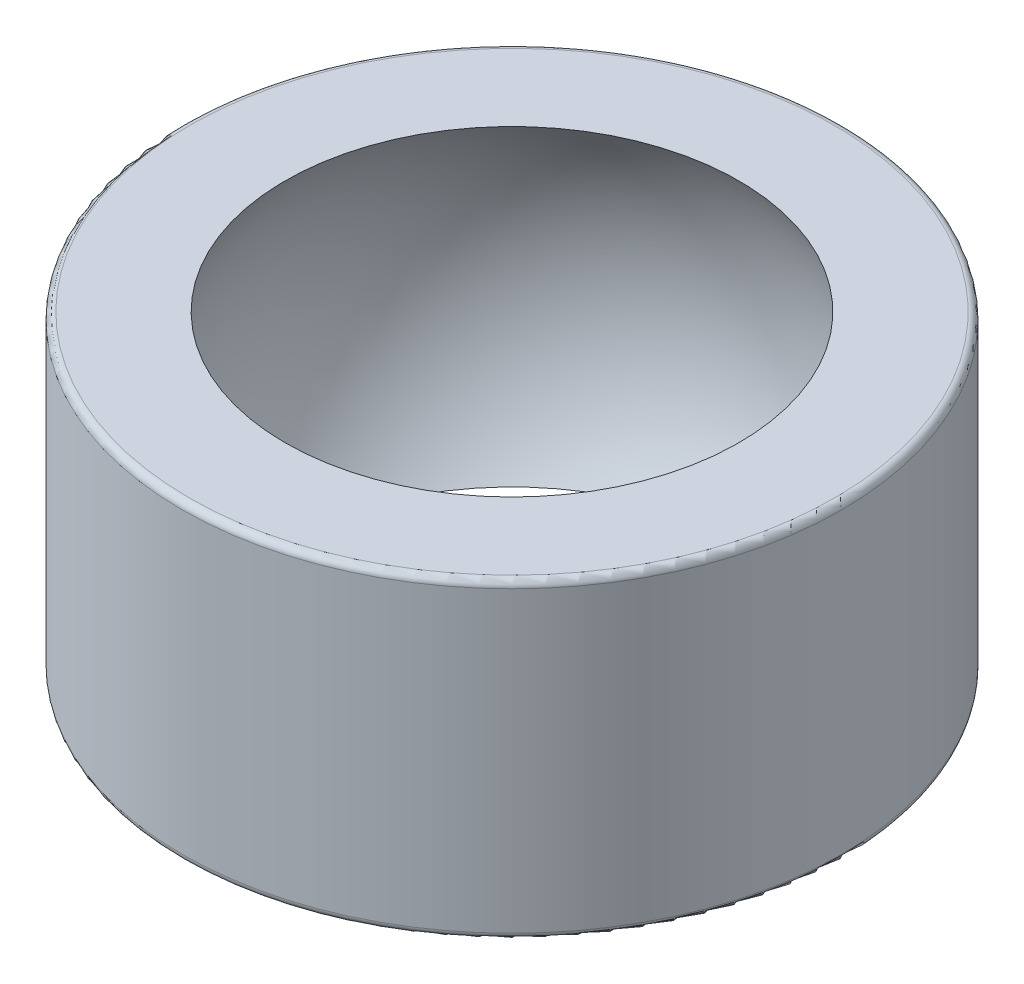
ISO-10303-21;
HEADER;
FILE_DESCRIPTION(('STEP AP214'),'2;1');
FILE_NAME('part.step','',(''),(''),'','','');
FILE_SCHEMA(('AUTOMOTIVE_DESIGN { 1 0 10303 214 1 1 1 1 }'));
ENDSEC;
DATA;
#1=APPLICATION_CONTEXT('core data for automotive mechanical design processes');
#2=APPLICATION_PROTOCOL_DEFINITION('international standard','automotive_design',2000,#1);
#3=PRODUCT_CONTEXT('',#1,'mechanical');
#4=PRODUCT('Part','Part','',(#3));
#5=PRODUCT_RELATED_PRODUCT_CATEGORY('part','',(#4));
#6=PRODUCT_DEFINITION_FORMATION('','',#4);
#7=PRODUCT_DEFINITION_CONTEXT('part definition',#1,'design');
#8=PRODUCT_DEFINITION('design','',#6,#7);
#9=PRODUCT_DEFINITION_SHAPE('','',#8);
#10=(LENGTH_UNIT() NAMED_UNIT(*) SI_UNIT(.MILLI.,.METRE.));
#11=(NAMED_UNIT(*) PLANE_ANGLE_UNIT() SI_UNIT($,.RADIAN.));
#12=(NAMED_UNIT(*) SI_UNIT($,.STERADIAN.) SOLID_ANGLE_UNIT());
#13=UNCERTAINTY_MEASURE_WITH_UNIT(LENGTH_MEASURE(1.E-05),#10,'distance_accuracy_value','');
#14=(GEOMETRIC_REPRESENTATION_CONTEXT(3) GLOBAL_UNCERTAINTY_ASSIGNED_CONTEXT((#13)) GLOBAL_UNIT_ASSIGNED_CONTEXT((#10,
#11,#12)) REPRESENTATION_CONTEXT('',''));
#15=CARTESIAN_POINT('',(0.,0.,0.));
#16=DIRECTION('',(0.,0.,1.));
#17=DIRECTION('',(1.,0.,0.));
#18=AXIS2_PLACEMENT_3D('',#15,#16,#17);
#19=CARTESIAN_POINT('',(0.,4.5,0.));
#20=DIRECTION('',(0.,-1.,0.));
#21=DIRECTION('',(0.,0.,-1.));
#22=AXIS2_PLACEMENT_3D('',#19,#20,#21);
#23=CYLINDRICAL_SURFACE('',#22,9.5);
#24=CARTESIAN_POINT('',(0.,-4.3,0.));
#25=DIRECTION('',(0.,1.,0.));
#26=DIRECTION('',(0.,0.,1.));
#27=AXIS2_PLACEMENT_3D('',#24,#25,#26);
#28=CIRCLE('',#27,9.5);
#29=CARTESIAN_POINT('',(0.,-4.3,9.5));
#30=VERTEX_POINT('',#29);
#31=EDGE_CURVE('E42',#30,#30,#28,.T.);
#32=ORIENTED_EDGE('',*,*,#31,.T.);
#33=EDGE_LOOP('',(#32));
#34=FACE_BOUND('',#33,.T.);
#35=CARTESIAN_POINT('',(0.,4.3,0.));
#36=DIRECTION('',(0.,1.,0.));
#37=DIRECTION('',(0.,0.,1.));
#38=AXIS2_PLACEMENT_3D('',#35,#36,#37);
#39=CIRCLE('',#38,9.5);
#40=CARTESIAN_POINT('',(0.,4.3,9.5));
#41=VERTEX_POINT('',#40);
#42=EDGE_CURVE('E46',#41,#41,#39,.F.);
#43=ORIENTED_EDGE('',*,*,#42,.T.);
#44=EDGE_LOOP('',(#43));
#45=FACE_BOUND('',#44,.T.);
#46=ADVANCED_FACE('F31',(#34,#45),#23,.T.);
#47=CARTESIAN_POINT('',(0.,4.5,0.));
#48=DIRECTION('',(0.,1.,0.));
#49=DIRECTION('',(0.,0.,1.));
#50=AXIS2_PLACEMENT_3D('',#47,#48,#49);
#51=PLANE('',#50);
#52=CARTESIAN_POINT('',(0.,4.5,0.));
#53=DIRECTION('',(0.,1.,0.));
#54=DIRECTION('',(0.,0.,1.));
#55=AXIS2_PLACEMENT_3D('',#52,#53,#54);
#56=CIRCLE('',#55,9.3);
#57=CARTESIAN_POINT('',(0.,4.5,9.3));
#58=VERTEX_POINT('',#57);
#59=EDGE_CURVE('E10',#58,#58,#56,.T.);
#60=ORIENTED_EDGE('',*,*,#59,.T.);
#61=EDGE_LOOP('',(#60));
#62=FACE_BOUND('',#61,.T.);
#63=CARTESIAN_POINT('',(0.,4.5,0.));
#64=DIRECTION('',(0.,1.,0.));
#65=DIRECTION('',(0.,0.,1.));
#66=AXIS2_PLACEMENT_3D('',#63,#64,#65);
#67=CIRCLE('',#66,6.54168174095928);
#68=CARTESIAN_POINT('',(0.,4.5,6.54168174095928));
#69=VERTEX_POINT('',#68);
#70=EDGE_CURVE('E51',#69,#69,#67,.T.);
#71=ORIENTED_EDGE('',*,*,#70,.F.);
#72=EDGE_LOOP('',(#71));
#73=FACE_BOUND('',#72,.T.);
#74=ADVANCED_FACE('F61',(#62,#73),#51,.T.);
#75=CARTESIAN_POINT('',(0.,-4.5,0.));
#76=DIRECTION('',(0.,1.,0.));
#77=DIRECTION('',(0.,0.,1.));
#78=AXIS2_PLACEMENT_3D('',#75,#76,#77);
#79=PLANE('',#78);
#80=CARTESIAN_POINT('',(0.,-4.5,0.));
#81=DIRECTION('',(0.,1.,0.));
#82=DIRECTION('',(0.,0.,1.));
#83=AXIS2_PLACEMENT_3D('',#80,#81,#82);
#84=CIRCLE('',#83,9.3);
#85=CARTESIAN_POINT('',(0.,-4.5,9.3));
#86=VERTEX_POINT('',#85);
#87=EDGE_CURVE('E38',#86,#86,#84,.F.);
#88=ORIENTED_EDGE('',*,*,#87,.T.);
#89=EDGE_LOOP('',(#88));
#90=FACE_BOUND('',#89,.T.);
#91=CARTESIAN_POINT('',(0.,-4.5,0.));
#92=DIRECTION('',(0.,1.,0.));
#93=DIRECTION('',(0.,0.,1.));
#94=AXIS2_PLACEMENT_3D('',#91,#92,#93);
#95=CIRCLE('',#94,6.54168174095928);
#96=CARTESIAN_POINT('',(0.,-4.5,6.54168174095928));
#97=VERTEX_POINT('',#96);
#98=EDGE_CURVE('E52',#97,#97,#95,.T.);
#99=ORIENTED_EDGE('',*,*,#98,.T.);
#100=EDGE_LOOP('',(#99));
#101=FACE_BOUND('',#100,.T.);
#102=ADVANCED_FACE('F63',(#90,#101),#79,.F.);
#103=CARTESIAN_POINT('',(0.,0.,0.));
#104=DIRECTION('',(0.,-1.,0.));
#105=DIRECTION('',(-1.,0.,0.));
#106=AXIS2_PLACEMENT_3D('',#103,#104,#105);
#107=SPHERICAL_SURFACE('',#106,7.94);
#108=ORIENTED_EDGE('',*,*,#70,.T.);
#109=EDGE_LOOP('',(#108));
#110=FACE_BOUND('',#109,.T.);
#111=ORIENTED_EDGE('',*,*,#98,.F.);
#112=EDGE_LOOP('',(#111));
#113=FACE_BOUND('',#112,.T.);
#114=ADVANCED_FACE('F58',(#110,#113),#107,.F.);
#115=CARTESIAN_POINT('',(0.,-4.3,0.));
#116=DIRECTION('',(0.,1.,0.));
#117=DIRECTION('',(0.,0.,1.));
#118=AXIS2_PLACEMENT_3D('',#115,#116,#117);
#119=TOROIDAL_SURFACE('',#118,9.3,0.2);
#120=ORIENTED_EDGE('',*,*,#87,.F.);
#121=EDGE_LOOP('',(#120));
#122=FACE_BOUND('',#121,.T.);
#123=ORIENTED_EDGE('',*,*,#31,.F.);
#124=EDGE_LOOP('',(#123));
#125=FACE_BOUND('',#124,.T.);
#126=ADVANCED_FACE('F73',(#122,#125),#119,.T.);
#127=CARTESIAN_POINT('',(0.,4.3,0.));
#128=DIRECTION('',(0.,1.,0.));
#129=DIRECTION('',(0.,0.,1.));
#130=AXIS2_PLACEMENT_3D('',#127,#128,#129);
#131=TOROIDAL_SURFACE('',#130,9.3,0.2);
#132=ORIENTED_EDGE('',*,*,#42,.F.);
#133=EDGE_LOOP('',(#132));
#134=FACE_BOUND('',#133,.T.);
#135=ORIENTED_EDGE('',*,*,#59,.F.);
#136=EDGE_LOOP('',(#135));
#137=FACE_BOUND('',#136,.T.);
#138=ADVANCED_FACE('F33',(#134,#137),#131,.T.);
#139=CLOSED_SHELL('',(#46,#74,#102,#114,#126,#138));
#140=MANIFOLD_SOLID_BREP('B2',#139);
#141=ADVANCED_BREP_SHAPE_REPRESENTATION('',(#18,#140),#14);
#142=SHAPE_DEFINITION_REPRESENTATION(#9,#141);
ENDSEC;
END-ISO-10303-21;
